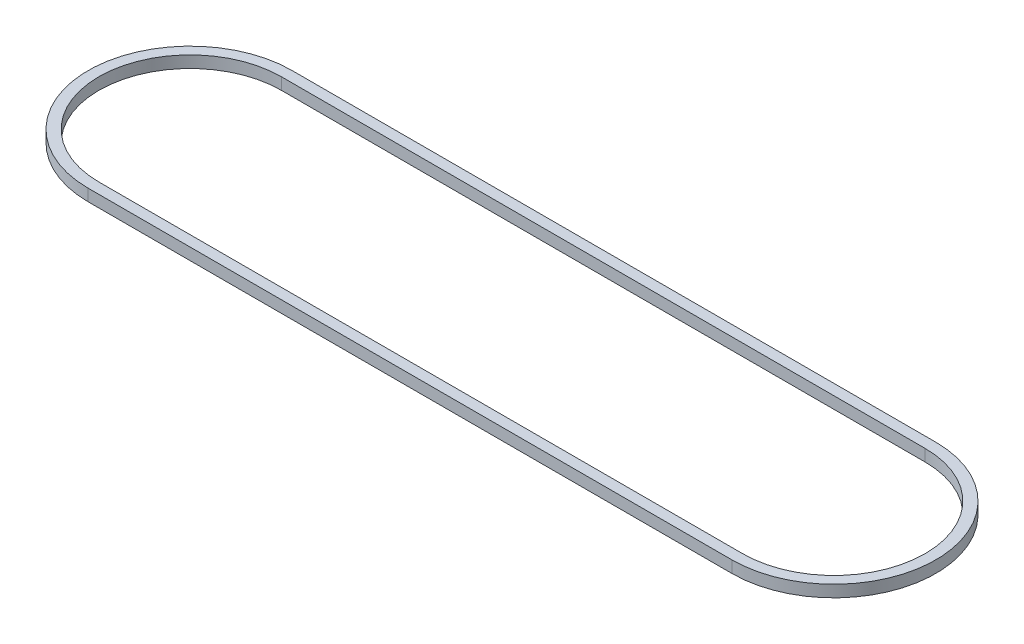
ISO-10303-21;
HEADER;
FILE_DESCRIPTION(('STEP AP214'),'2;1');
FILE_NAME('part.step','',(''),(''),'','','');
FILE_SCHEMA(('AUTOMOTIVE_DESIGN { 1 0 10303 214 1 1 1 1 }'));
ENDSEC;
DATA;
#1=APPLICATION_CONTEXT('core data for automotive mechanical design processes');
#2=APPLICATION_PROTOCOL_DEFINITION('international standard','automotive_design',2000,#1);
#3=PRODUCT_CONTEXT('',#1,'mechanical');
#4=PRODUCT('Part','Part','',(#3));
#5=PRODUCT_RELATED_PRODUCT_CATEGORY('part','',(#4));
#6=PRODUCT_DEFINITION_FORMATION('','',#4);
#7=PRODUCT_DEFINITION_CONTEXT('part definition',#1,'design');
#8=PRODUCT_DEFINITION('design','',#6,#7);
#9=PRODUCT_DEFINITION_SHAPE('','',#8);
#10=(LENGTH_UNIT() NAMED_UNIT(*) SI_UNIT(.MILLI.,.METRE.));
#11=(NAMED_UNIT(*) PLANE_ANGLE_UNIT() SI_UNIT($,.RADIAN.));
#12=(NAMED_UNIT(*) SI_UNIT($,.STERADIAN.) SOLID_ANGLE_UNIT());
#13=UNCERTAINTY_MEASURE_WITH_UNIT(LENGTH_MEASURE(1.E-05),#10,'distance_accuracy_value','');
#14=(GEOMETRIC_REPRESENTATION_CONTEXT(3) GLOBAL_UNCERTAINTY_ASSIGNED_CONTEXT((#13)) GLOBAL_UNIT_ASSIGNED_CONTEXT((#10,
#11,#12)) REPRESENTATION_CONTEXT('',''));
#15=CARTESIAN_POINT('',(0.,0.,0.));
#16=DIRECTION('',(0.,0.,1.));
#17=DIRECTION('',(1.,0.,0.));
#18=AXIS2_PLACEMENT_3D('',#15,#16,#17);
#19=CARTESIAN_POINT('',(-3000.,110.,0.));
#20=DIRECTION('',(0.,-1.,0.));
#21=DIRECTION('',(0.,0.,-1.));
#22=AXIS2_PLACEMENT_3D('',#19,#20,#21);
#23=CYLINDRICAL_SURFACE('',#22,950.);
#24=CARTESIAN_POINT('',(-3000.,0.,0.));
#25=DIRECTION('',(0.,1.,0.));
#26=DIRECTION('',(0.,0.,1.));
#27=AXIS2_PLACEMENT_3D('',#24,#25,#26);
#28=CIRCLE('',#27,950.);
#29=CARTESIAN_POINT('',(-3000.,0.,-950.));
#30=VERTEX_POINT('',#29);
#31=CARTESIAN_POINT('',(-3000.,0.,950.));
#32=VERTEX_POINT('',#31);
#33=EDGE_CURVE('E113',#30,#32,#28,.T.);
#34=ORIENTED_EDGE('',*,*,#33,.T.);
#35=DIRECTION('',(0.,-1.,0.));
#36=VECTOR('',#35,1.);
#37=CARTESIAN_POINT('',(-3000.,110.,950.));
#38=LINE('',#37,#36);
#39=CARTESIAN_POINT('',(-3000.,110.,950.));
#40=VERTEX_POINT('',#39);
#41=EDGE_CURVE('E122',#40,#32,#38,.T.);
#42=ORIENTED_EDGE('',*,*,#41,.F.);
#43=CARTESIAN_POINT('',(-3000.,110.,0.));
#44=DIRECTION('',(0.,1.,0.));
#45=DIRECTION('',(0.,0.,1.));
#46=AXIS2_PLACEMENT_3D('',#43,#44,#45);
#47=CIRCLE('',#46,950.);
#48=CARTESIAN_POINT('',(-3000.,110.,-950.));
#49=VERTEX_POINT('',#48);
#50=EDGE_CURVE('E149',#49,#40,#47,.T.);
#51=ORIENTED_EDGE('',*,*,#50,.F.);
#52=DIRECTION('',(0.,-1.,0.));
#53=VECTOR('',#52,1.);
#54=CARTESIAN_POINT('',(-3000.,110.,-950.));
#55=LINE('',#54,#53);
#56=EDGE_CURVE('E141',#49,#30,#55,.T.);
#57=ORIENTED_EDGE('',*,*,#56,.T.);
#58=EDGE_LOOP('',(#34,#42,#51,#57));
#59=FACE_BOUND('',#58,.T.);
#60=ADVANCED_FACE('F39',(#59),#23,.T.);
#61=CARTESIAN_POINT('',(3000.,110.,949.999999999999));
#62=DIRECTION('',(0.,0.,-1.));
#63=DIRECTION('',(-1.,0.,0.));
#64=AXIS2_PLACEMENT_3D('',#61,#62,#63);
#65=PLANE('',#64);
#66=DIRECTION('',(1.,0.,0.));
#67=VECTOR('',#66,1.);
#68=CARTESIAN_POINT('',(3000.,0.,949.999999999999));
#69=LINE('',#68,#67);
#70=CARTESIAN_POINT('',(3000.,0.,949.999999999999));
#71=VERTEX_POINT('',#70);
#72=EDGE_CURVE('E153',#32,#71,#69,.T.);
#73=ORIENTED_EDGE('',*,*,#72,.T.);
#74=DIRECTION('',(0.,-1.,0.));
#75=VECTOR('',#74,1.);
#76=CARTESIAN_POINT('',(3000.,110.,949.999999999999));
#77=LINE('',#76,#75);
#78=CARTESIAN_POINT('',(3000.,110.,949.999999999999));
#79=VERTEX_POINT('',#78);
#80=EDGE_CURVE('E133',#79,#71,#77,.T.);
#81=ORIENTED_EDGE('',*,*,#80,.F.);
#82=DIRECTION('',(1.,0.,0.));
#83=VECTOR('',#82,1.);
#84=CARTESIAN_POINT('',(3000.,110.,949.999999999999));
#85=LINE('',#84,#83);
#86=EDGE_CURVE('E164',#40,#79,#85,.T.);
#87=ORIENTED_EDGE('',*,*,#86,.F.);
#88=ORIENTED_EDGE('',*,*,#41,.T.);
#89=EDGE_LOOP('',(#73,#81,#87,#88));
#90=FACE_BOUND('',#89,.T.);
#91=ADVANCED_FACE('F204',(#90),#65,.F.);
#92=CARTESIAN_POINT('',(3000.,110.,-8.88178419700125E-13));
#93=DIRECTION('',(0.,-1.,0.));
#94=DIRECTION('',(0.,0.,-1.));
#95=AXIS2_PLACEMENT_3D('',#92,#93,#94);
#96=CYLINDRICAL_SURFACE('',#95,950.);
#97=CARTESIAN_POINT('',(3000.,0.,-8.88178419700125E-13));
#98=DIRECTION('',(0.,1.,0.));
#99=DIRECTION('',(0.,0.,1.));
#100=AXIS2_PLACEMENT_3D('',#97,#98,#99);
#101=CIRCLE('',#100,950.);
#102=CARTESIAN_POINT('',(3000.,0.,-950.000000000001));
#103=VERTEX_POINT('',#102);
#104=EDGE_CURVE('E150',#71,#103,#101,.T.);
#105=ORIENTED_EDGE('',*,*,#104,.T.);
#106=DIRECTION('',(0.,-1.,0.));
#107=VECTOR('',#106,1.);
#108=CARTESIAN_POINT('',(3000.,110.,-950.000000000001));
#109=LINE('',#108,#107);
#110=CARTESIAN_POINT('',(3000.,110.,-950.000000000001));
#111=VERTEX_POINT('',#110);
#112=EDGE_CURVE('E137',#111,#103,#109,.T.);
#113=ORIENTED_EDGE('',*,*,#112,.F.);
#114=CARTESIAN_POINT('',(3000.,110.,-8.88178419700125E-13));
#115=DIRECTION('',(0.,1.,0.));
#116=DIRECTION('',(0.,0.,1.));
#117=AXIS2_PLACEMENT_3D('',#114,#115,#116);
#118=CIRCLE('',#117,950.);
#119=EDGE_CURVE('E161',#79,#111,#118,.T.);
#120=ORIENTED_EDGE('',*,*,#119,.F.);
#121=ORIENTED_EDGE('',*,*,#80,.T.);
#122=EDGE_LOOP('',(#105,#113,#120,#121));
#123=FACE_BOUND('',#122,.T.);
#124=ADVANCED_FACE('F209',(#123),#96,.T.);
#125=CARTESIAN_POINT('',(3000.,110.,-950.000000000001));
#126=DIRECTION('',(0.,0.,1.));
#127=DIRECTION('',(1.,0.,0.));
#128=AXIS2_PLACEMENT_3D('',#125,#126,#127);
#129=PLANE('',#128);
#130=DIRECTION('',(-1.,0.,0.));
#131=VECTOR('',#130,1.);
#132=CARTESIAN_POINT('',(3000.,0.,-950.000000000001));
#133=LINE('',#132,#131);
#134=EDGE_CURVE('E146',#103,#30,#133,.T.);
#135=ORIENTED_EDGE('',*,*,#134,.T.);
#136=ORIENTED_EDGE('',*,*,#56,.F.);
#137=DIRECTION('',(-1.,0.,0.));
#138=VECTOR('',#137,1.);
#139=CARTESIAN_POINT('',(3000.,110.,-950.000000000001));
#140=LINE('',#139,#138);
#141=EDGE_CURVE('E145',#111,#49,#140,.T.);
#142=ORIENTED_EDGE('',*,*,#141,.F.);
#143=ORIENTED_EDGE('',*,*,#112,.T.);
#144=EDGE_LOOP('',(#135,#136,#142,#143));
#145=FACE_BOUND('',#144,.T.);
#146=ADVANCED_FACE('F222',(#145),#129,.F.);
#147=CARTESIAN_POINT('',(-3000.,110.,0.));
#148=DIRECTION('',(0.,1.,0.));
#149=DIRECTION('',(0.,0.,1.));
#150=AXIS2_PLACEMENT_3D('',#147,#148,#149);
#151=PLANE('',#150);
#152=CARTESIAN_POINT('',(-3000.,110.,0.));
#153=DIRECTION('',(0.,1.,0.));
#154=DIRECTION('',(0.,0.,1.));
#155=AXIS2_PLACEMENT_3D('',#152,#153,#154);
#156=CIRCLE('',#155,850.);
#157=CARTESIAN_POINT('',(-3000.,110.,-850.));
#158=VERTEX_POINT('',#157);
#159=CARTESIAN_POINT('',(-3000.,110.,850.));
#160=VERTEX_POINT('',#159);
#161=EDGE_CURVE('E110',#158,#160,#156,.T.);
#162=ORIENTED_EDGE('',*,*,#161,.F.);
#163=DIRECTION('',(-1.,0.,0.));
#164=VECTOR('',#163,1.);
#165=CARTESIAN_POINT('',(3000.,110.,-850.000000000001));
#166=LINE('',#165,#164);
#167=CARTESIAN_POINT('',(3000.,110.,-850.000000000001));
#168=VERTEX_POINT('',#167);
#169=EDGE_CURVE('E170',#168,#158,#166,.T.);
#170=ORIENTED_EDGE('',*,*,#169,.F.);
#171=CARTESIAN_POINT('',(3000.,110.,-8.88178419700125E-13));
#172=DIRECTION('',(0.,1.,0.));
#173=DIRECTION('',(0.,0.,1.));
#174=AXIS2_PLACEMENT_3D('',#171,#172,#173);
#175=CIRCLE('',#174,850.);
#176=CARTESIAN_POINT('',(3000.,110.,849.999999999999));
#177=VERTEX_POINT('',#176);
#178=EDGE_CURVE('E174',#177,#168,#175,.T.);
#179=ORIENTED_EDGE('',*,*,#178,.F.);
#180=DIRECTION('',(1.,0.,0.));
#181=VECTOR('',#180,1.);
#182=CARTESIAN_POINT('',(3000.,110.,849.999999999999));
#183=LINE('',#182,#181);
#184=EDGE_CURVE('E177',#160,#177,#183,.T.);
#185=ORIENTED_EDGE('',*,*,#184,.F.);
#186=EDGE_LOOP('',(#162,#170,#179,#185));
#187=FACE_BOUND('',#186,.T.);
#188=ORIENTED_EDGE('',*,*,#50,.T.);
#189=ORIENTED_EDGE('',*,*,#86,.T.);
#190=ORIENTED_EDGE('',*,*,#119,.T.);
#191=ORIENTED_EDGE('',*,*,#141,.T.);
#192=EDGE_LOOP('',(#188,#189,#190,#191));
#193=FACE_BOUND('',#192,.T.);
#194=ADVANCED_FACE('F190',(#187,#193),#151,.T.);
#195=CARTESIAN_POINT('',(-3000.,0.,0.));
#196=DIRECTION('',(0.,1.,0.));
#197=DIRECTION('',(0.,0.,1.));
#198=AXIS2_PLACEMENT_3D('',#195,#196,#197);
#199=PLANE('',#198);
#200=DIRECTION('',(-1.,0.,0.));
#201=VECTOR('',#200,1.);
#202=CARTESIAN_POINT('',(-3000.,0.,-850.));
#203=LINE('',#202,#201);
#204=CARTESIAN_POINT('',(3000.,0.,-850.000000000001));
#205=VERTEX_POINT('',#204);
#206=CARTESIAN_POINT('',(-3000.,0.,-850.));
#207=VERTEX_POINT('',#206);
#208=EDGE_CURVE('E47',#205,#207,#203,.T.);
#209=ORIENTED_EDGE('',*,*,#208,.T.);
#210=CARTESIAN_POINT('',(-3000.,0.,0.));
#211=DIRECTION('',(0.,1.,0.));
#212=DIRECTION('',(0.,0.,1.));
#213=AXIS2_PLACEMENT_3D('',#210,#211,#212);
#214=CIRCLE('',#213,850.);
#215=CARTESIAN_POINT('',(-3000.,0.,850.));
#216=VERTEX_POINT('',#215);
#217=EDGE_CURVE('E11',#207,#216,#214,.T.);
#218=ORIENTED_EDGE('',*,*,#217,.T.);
#219=DIRECTION('',(1.,0.,0.));
#220=VECTOR('',#219,1.);
#221=CARTESIAN_POINT('',(-3000.,0.,850.));
#222=LINE('',#221,#220);
#223=CARTESIAN_POINT('',(3000.,0.,849.999999999999));
#224=VERTEX_POINT('',#223);
#225=EDGE_CURVE('E116',#216,#224,#222,.T.);
#226=ORIENTED_EDGE('',*,*,#225,.T.);
#227=CARTESIAN_POINT('',(3000.,0.,0.));
#228=DIRECTION('',(0.,1.,0.));
#229=DIRECTION('',(0.,0.,1.));
#230=AXIS2_PLACEMENT_3D('',#227,#228,#229);
#231=CIRCLE('',#230,850.);
#232=EDGE_CURVE('E121',#224,#205,#231,.T.);
#233=ORIENTED_EDGE('',*,*,#232,.T.);
#234=EDGE_LOOP('',(#209,#218,#226,#233));
#235=FACE_BOUND('',#234,.T.);
#236=ORIENTED_EDGE('',*,*,#33,.F.);
#237=ORIENTED_EDGE('',*,*,#134,.F.);
#238=ORIENTED_EDGE('',*,*,#104,.F.);
#239=ORIENTED_EDGE('',*,*,#72,.F.);
#240=EDGE_LOOP('',(#236,#237,#238,#239));
#241=FACE_BOUND('',#240,.T.);
#242=ADVANCED_FACE('F124',(#235,#241),#199,.F.);
#243=CARTESIAN_POINT('',(-3000.,110.,0.));
#244=DIRECTION('',(0.,-1.,0.));
#245=DIRECTION('',(0.,0.,-1.));
#246=AXIS2_PLACEMENT_3D('',#243,#244,#245);
#247=CYLINDRICAL_SURFACE('',#246,850.);
#248=DIRECTION('',(0.,1.,0.));
#249=VECTOR('',#248,1.);
#250=CARTESIAN_POINT('',(-3000.,110.,850.));
#251=LINE('',#250,#249);
#252=EDGE_CURVE('E105',#160,#216,#251,.F.);
#253=ORIENTED_EDGE('',*,*,#252,.T.);
#254=ORIENTED_EDGE('',*,*,#217,.F.);
#255=DIRECTION('',(0.,-1.,0.));
#256=VECTOR('',#255,1.);
#257=CARTESIAN_POINT('',(-3000.,110.,-850.));
#258=LINE('',#257,#256);
#259=EDGE_CURVE('E173',#158,#207,#258,.T.);
#260=ORIENTED_EDGE('',*,*,#259,.F.);
#261=ORIENTED_EDGE('',*,*,#161,.T.);
#262=EDGE_LOOP('',(#253,#254,#260,#261));
#263=FACE_BOUND('',#262,.T.);
#264=ADVANCED_FACE('F106',(#263),#247,.F.);
#265=CARTESIAN_POINT('',(3000.,110.,849.999999999999));
#266=DIRECTION('',(0.,0.,-1.));
#267=DIRECTION('',(-1.,0.,0.));
#268=AXIS2_PLACEMENT_3D('',#265,#266,#267);
#269=PLANE('',#268);
#270=DIRECTION('',(0.,-1.,0.));
#271=VECTOR('',#270,1.);
#272=CARTESIAN_POINT('',(3000.,110.,849.999999999999));
#273=LINE('',#272,#271);
#274=EDGE_CURVE('E54',#177,#224,#273,.T.);
#275=ORIENTED_EDGE('',*,*,#274,.T.);
#276=ORIENTED_EDGE('',*,*,#225,.F.);
#277=ORIENTED_EDGE('',*,*,#252,.F.);
#278=ORIENTED_EDGE('',*,*,#184,.T.);
#279=EDGE_LOOP('',(#275,#276,#277,#278));
#280=FACE_BOUND('',#279,.T.);
#281=ADVANCED_FACE('F117',(#280),#269,.T.);
#282=CARTESIAN_POINT('',(3000.,110.,-8.88178419700125E-13));
#283=DIRECTION('',(0.,-1.,0.));
#284=DIRECTION('',(0.,0.,-1.));
#285=AXIS2_PLACEMENT_3D('',#282,#283,#284);
#286=CYLINDRICAL_SURFACE('',#285,850.);
#287=DIRECTION('',(0.,1.,0.));
#288=VECTOR('',#287,1.);
#289=CARTESIAN_POINT('',(3000.,110.,-850.000000000001));
#290=LINE('',#289,#288);
#291=EDGE_CURVE('E62',#168,#205,#290,.F.);
#292=ORIENTED_EDGE('',*,*,#291,.T.);
#293=ORIENTED_EDGE('',*,*,#232,.F.);
#294=ORIENTED_EDGE('',*,*,#274,.F.);
#295=ORIENTED_EDGE('',*,*,#178,.T.);
#296=EDGE_LOOP('',(#292,#293,#294,#295));
#297=FACE_BOUND('',#296,.T.);
#298=ADVANCED_FACE('F194',(#297),#286,.F.);
#299=CARTESIAN_POINT('',(3000.,110.,-850.000000000001));
#300=DIRECTION('',(0.,0.,1.));
#301=DIRECTION('',(1.,0.,0.));
#302=AXIS2_PLACEMENT_3D('',#299,#300,#301);
#303=PLANE('',#302);
#304=ORIENTED_EDGE('',*,*,#259,.T.);
#305=ORIENTED_EDGE('',*,*,#208,.F.);
#306=ORIENTED_EDGE('',*,*,#291,.F.);
#307=ORIENTED_EDGE('',*,*,#169,.T.);
#308=EDGE_LOOP('',(#304,#305,#306,#307));
#309=FACE_BOUND('',#308,.T.);
#310=ADVANCED_FACE('F187',(#309),#303,.T.);
#311=CLOSED_SHELL('',(#60,#91,#124,#146,#194,#242,#264,#281,#298,#310));
#312=MANIFOLD_SOLID_BREP('B2',#311);
#313=ADVANCED_BREP_SHAPE_REPRESENTATION('',(#18,#312),#14);
#314=SHAPE_DEFINITION_REPRESENTATION(#9,#313);
ENDSEC;
END-ISO-10303-21;
